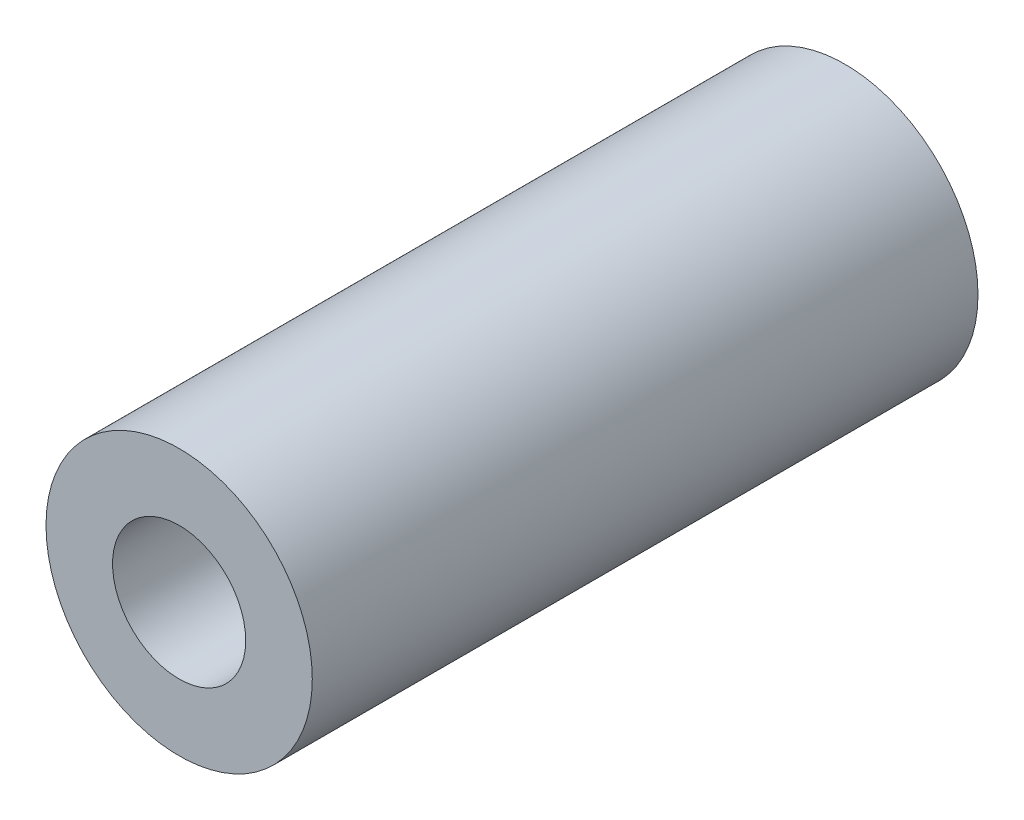
ISO-10303-21;
HEADER;
FILE_DESCRIPTION(('STEP AP214'),'2;1');
FILE_NAME('part.step','',(''),(''),'','','');
FILE_SCHEMA(('AUTOMOTIVE_DESIGN { 1 0 10303 214 1 1 1 1 }'));
ENDSEC;
DATA;
#1=APPLICATION_CONTEXT('core data for automotive mechanical design processes');
#2=APPLICATION_PROTOCOL_DEFINITION('international standard','automotive_design',2000,#1);
#3=PRODUCT_CONTEXT('',#1,'mechanical');
#4=PRODUCT('Part','Part','',(#3));
#5=PRODUCT_RELATED_PRODUCT_CATEGORY('part','',(#4));
#6=PRODUCT_DEFINITION_FORMATION('','',#4);
#7=PRODUCT_DEFINITION_CONTEXT('part definition',#1,'design');
#8=PRODUCT_DEFINITION('design','',#6,#7);
#9=PRODUCT_DEFINITION_SHAPE('','',#8);
#10=(LENGTH_UNIT() NAMED_UNIT(*) SI_UNIT(.MILLI.,.METRE.));
#11=(NAMED_UNIT(*) PLANE_ANGLE_UNIT() SI_UNIT($,.RADIAN.));
#12=(NAMED_UNIT(*) SI_UNIT($,.STERADIAN.) SOLID_ANGLE_UNIT());
#13=UNCERTAINTY_MEASURE_WITH_UNIT(LENGTH_MEASURE(1.E-05),#10,'distance_accuracy_value','');
#14=(GEOMETRIC_REPRESENTATION_CONTEXT(3) GLOBAL_UNCERTAINTY_ASSIGNED_CONTEXT((#13)) GLOBAL_UNIT_ASSIGNED_CONTEXT((#10,
#11,#12)) REPRESENTATION_CONTEXT('',''));
#15=CARTESIAN_POINT('',(0.,0.,0.));
#16=DIRECTION('',(0.,0.,1.));
#17=DIRECTION('',(1.,0.,0.));
#18=AXIS2_PLACEMENT_3D('',#15,#16,#17);
#19=CARTESIAN_POINT('',(0.,0.,10.));
#20=DIRECTION('',(0.,0.,1.));
#21=DIRECTION('',(1.,0.,0.));
#22=AXIS2_PLACEMENT_3D('',#19,#20,#21);
#23=PLANE('',#22);
#24=CARTESIAN_POINT('',(0.,0.,10.));
#25=DIRECTION('',(0.,0.,1.));
#26=DIRECTION('',(1.,0.,0.));
#27=AXIS2_PLACEMENT_3D('',#24,#25,#26);
#28=CIRCLE('',#27,2.);
#29=CARTESIAN_POINT('',(2.,0.,10.));
#30=VERTEX_POINT('',#29);
#31=EDGE_CURVE('E66',#30,#30,#28,.T.);
#32=ORIENTED_EDGE('',*,*,#31,.T.);
#33=EDGE_LOOP('',(#32));
#34=FACE_BOUND('',#33,.T.);
#35=CARTESIAN_POINT('',(0.,0.,10.));
#36=DIRECTION('',(0.,0.,1.));
#37=DIRECTION('',(1.,0.,0.));
#38=AXIS2_PLACEMENT_3D('',#35,#36,#37);
#39=CIRCLE('',#38,1.);
#40=CARTESIAN_POINT('',(1.,0.,10.));
#41=VERTEX_POINT('',#40);
#42=EDGE_CURVE('E100',#41,#41,#39,.T.);
#43=ORIENTED_EDGE('',*,*,#42,.F.);
#44=EDGE_LOOP('',(#43));
#45=FACE_BOUND('',#44,.T.);
#46=ADVANCED_FACE('F33',(#34,#45),#23,.T.);
#47=CARTESIAN_POINT('',(0.,0.,0.));
#48=DIRECTION('',(0.,0.,1.));
#49=DIRECTION('',(1.,0.,0.));
#50=AXIS2_PLACEMENT_3D('',#47,#48,#49);
#51=PLANE('',#50);
#52=CARTESIAN_POINT('',(0.,0.,0.));
#53=DIRECTION('',(0.,0.,1.));
#54=DIRECTION('',(1.,0.,0.));
#55=AXIS2_PLACEMENT_3D('',#52,#53,#54);
#56=CIRCLE('',#55,2.);
#57=CARTESIAN_POINT('',(2.,0.,0.));
#58=VERTEX_POINT('',#57);
#59=EDGE_CURVE('E103',#58,#58,#56,.T.);
#60=ORIENTED_EDGE('',*,*,#59,.F.);
#61=EDGE_LOOP('',(#60));
#62=FACE_BOUND('',#61,.T.);
#63=CARTESIAN_POINT('',(0.,0.,0.));
#64=DIRECTION('',(0.,0.,1.));
#65=DIRECTION('',(1.,0.,0.));
#66=AXIS2_PLACEMENT_3D('',#63,#64,#65);
#67=CIRCLE('',#66,1.);
#68=CARTESIAN_POINT('',(1.,0.,0.));
#69=VERTEX_POINT('',#68);
#70=EDGE_CURVE('E99',#69,#69,#67,.T.);
#71=ORIENTED_EDGE('',*,*,#70,.T.);
#72=EDGE_LOOP('',(#71));
#73=FACE_BOUND('',#72,.T.);
#74=ADVANCED_FACE('F111',(#62,#73),#51,.F.);
#75=CARTESIAN_POINT('',(0.,0.,10.));
#76=DIRECTION('',(0.,0.,-1.));
#77=DIRECTION('',(-1.,0.,0.));
#78=AXIS2_PLACEMENT_3D('',#75,#76,#77);
#79=CYLINDRICAL_SURFACE('',#78,2.);
#80=CARTESIAN_POINT('',(-2.,0.,2.71095));
#81=CARTESIAN_POINT('',(-1.99999648723784,0.065167737982772,2.71095375462478));
#82=CARTESIAN_POINT('',(-1.99678434338157,0.130370483013649,2.71592202732706));
#83=CARTESIAN_POINT('',(-1.98424617946316,0.258725908152528,2.73550903529616));
#84=CARTESIAN_POINT('',(-1.97491408735255,0.321876486776672,2.75013735510309));
#85=CARTESIAN_POINT('',(-1.95106736485164,0.444067176393795,2.7881701410669));
#86=CARTESIAN_POINT('',(-1.93657728578644,0.503125203079368,2.81153305776181));
#87=CARTESIAN_POINT('',(-1.90360002555391,0.616266693541774,2.86606271548572));
#88=CARTESIAN_POINT('',(-1.88511256993597,0.670349815389571,2.89722999236722));
#89=CARTESIAN_POINT('',(-1.84384321961621,0.7770302428952,2.96929472969139));
#90=CARTESIAN_POINT('',(-1.82083314015086,0.829139166545481,3.01078178119877));
#91=CARTESIAN_POINT('',(-1.77347282262379,0.926128524160324,3.10092932136109));
#92=CARTESIAN_POINT('',(-1.7491207665335,0.970998811774901,3.14959969908872));
#93=CARTESIAN_POINT('',(-1.69754639774823,1.05891046502727,3.26100975927525));
#94=CARTESIAN_POINT('',(-1.67042318275437,1.10073164102683,3.32476613147918));
#95=CARTESIAN_POINT('',(-1.62051370578226,1.17297334798858,3.45997039658612));
#96=CARTESIAN_POINT('',(-1.59772001613453,1.20341349259878,3.53140478130664));
#97=CARTESIAN_POINT('',(-1.56559101453485,1.24475492944445,3.66018362725927));
#98=CARTESIAN_POINT('',(-1.55428020251651,1.25872209890613,3.71604690600869));
#99=CARTESIAN_POINT('',(-1.53756497024471,1.27909062285749,3.82996385295507));
#100=CARTESIAN_POINT('',(-1.53215137771923,1.28550372786894,3.88801397390373));
#101=CARTESIAN_POINT('',(-1.52805632142403,1.29037065838595,4.00488428094427));
#102=CARTESIAN_POINT('',(-1.5293967034274,1.28879865587834,4.06370635131187));
#103=CARTESIAN_POINT('',(-1.53863844516895,1.27774772392529,4.18009541008909));
#104=CARTESIAN_POINT('',(-1.54654525451818,1.26826222688057,4.2376613152428));
#105=CARTESIAN_POINT('',(-1.5673966341176,1.24238840648332,4.3482021898132));
#106=CARTESIAN_POINT('',(-1.58017171147047,1.22623094136132,4.40126515236337));
#107=CARTESIAN_POINT('',(-1.60932961977698,1.18770386808887,4.50400737485829));
#108=CARTESIAN_POINT('',(-1.62571364341523,1.1653322056309,4.5536855090619));
#109=CARTESIAN_POINT('',(-1.66410130352081,1.11000344543621,4.65856814016826));
#110=CARTESIAN_POINT('',(-1.68657759839896,1.07583247786185,4.71295833616382));
#111=CARTESIAN_POINT('',(-1.73258422953482,1.00006068281097,4.81585401554424));
#112=CARTESIAN_POINT('',(-1.75611580069316,0.958450970951189,4.86435234441452));
#113=CARTESIAN_POINT('',(-1.80674821164721,0.859814571293041,4.96339311941244));
#114=CARTESIAN_POINT('',(-1.83368994974637,0.801360081160853,5.01261056981689));
#115=CARTESIAN_POINT('',(-1.88366724266534,0.675547340102675,5.10052551515804));
#116=CARTESIAN_POINT('',(-1.90670689178619,0.608198555361343,5.13923406270113));
#117=CARTESIAN_POINT('',(-1.94240847922352,0.480159094072421,5.19792594018133));
#118=CARTESIAN_POINT('',(-1.95622218721637,0.42079412843155,5.2200999553022));
#119=CARTESIAN_POINT('',(-1.97856693497824,0.298535128665473,5.2556151015817));
#120=CARTESIAN_POINT('',(-1.98710226353511,0.235644005054258,5.26896340441798));
#121=CARTESIAN_POINT('',(-1.99812522144204,0.107811854794137,5.28615649911869));
#122=CARTESIAN_POINT('',(-2.00059163816014,0.0428644394233644,5.28996795768829));
#123=CARTESIAN_POINT('',(-1.99916710753198,-0.0867959339275948,5.28775771308105));
#124=CARTESIAN_POINT('',(-1.99527590902767,-0.151508882543937,5.28173562142912));
#125=CARTESIAN_POINT('',(-1.98191225562139,-0.275089617102515,5.26082720710148));
#126=CARTESIAN_POINT('',(-1.97276411752539,-0.33408189373329,5.24645547490619));
#127=CARTESIAN_POINT('',(-1.94990311537933,-0.448658025481737,5.20994795895465));
#128=CARTESIAN_POINT('',(-1.93618948671255,-0.50424130782194,5.18781087464368));
#129=CARTESIAN_POINT('',(-1.90407345315059,-0.614864054823506,5.13473543016663));
#130=CARTESIAN_POINT('',(-1.88540407100072,-0.669574716082009,5.10327715036559));
#131=CARTESIAN_POINT('',(-1.84533685365772,-0.77319074000912,5.03331533695288));
#132=CARTESIAN_POINT('',(-1.82393697751677,-0.822091706789152,4.99480652385495));
#133=CARTESIAN_POINT('',(-1.77648218011437,-0.920619409913459,4.90510107456109));
#134=CARTESIAN_POINT('',(-1.75021773177379,-0.969199436015183,4.85286386143595));
#135=CARTESIAN_POINT('',(-1.69845377056349,-1.05729134413475,4.74085340653544));
#136=CARTESIAN_POINT('',(-1.67295446698287,-1.09680076438609,4.68107812572863));
#137=CARTESIAN_POINT('',(-1.62865940669592,-1.16137862409304,4.56283215103183));
#138=CARTESIAN_POINT('',(-1.60942321502515,-1.18765286670557,4.50518919337232));
#139=CARTESIAN_POINT('',(-1.57594152679878,-1.23173785204809,4.38539948045304));
#140=CARTESIAN_POINT('',(-1.56168925610576,-1.24956009455793,4.32325897808888));
#141=CARTESIAN_POINT('',(-1.54026322111922,-1.27588859511656,4.19511225773113));
#142=CARTESIAN_POINT('',(-1.53316093803208,-1.28430086879804,4.12907385699148));
#143=CARTESIAN_POINT('',(-1.52773467722786,-1.29075602786149,3.99615236014558));
#144=CARTESIAN_POINT('',(-1.52940309413689,-1.2888078970874,3.929270046022));
#145=CARTESIAN_POINT('',(-1.5402288476632,-1.27582980034042,3.80742548225821));
#146=CARTESIAN_POINT('',(-1.54821283640159,-1.26622103028561,3.75219294648086));
#147=CARTESIAN_POINT('',(-1.56909773275725,-1.2402455693829,3.64429665457542));
#148=CARTESIAN_POINT('',(-1.58200358191949,-1.22387208538477,3.59163554028939));
#149=CARTESIAN_POINT('',(-1.61637720431071,-1.17829921878191,3.47213438769121));
#150=CARTESIAN_POINT('',(-1.63926305271541,-1.14662529898609,3.40664851463977));
#151=CARTESIAN_POINT('',(-1.68809417828115,-1.07344088716677,3.28266243780609));
#152=CARTESIAN_POINT('',(-1.71404411073424,-1.03191532830074,3.22417314256659));
#153=CARTESIAN_POINT('',(-1.76653870930484,-0.939262938599474,3.11418410334728));
#154=CARTESIAN_POINT('',(-1.79308672081683,-0.888018244778735,3.06278517241429));
#155=CARTESIAN_POINT('',(-1.84390923237518,-0.776992404688265,2.96888071850678));
#156=CARTESIAN_POINT('',(-1.86818583484652,-0.7172192844154,2.92636692552299));
#157=CARTESIAN_POINT('',(-1.90942948072095,-0.597958031199053,2.85620388062454));
#158=CARTESIAN_POINT('',(-1.92692993445005,-0.539357056655816,2.82736410298082));
#159=CARTESIAN_POINT('',(-1.95696565924725,-0.417384850095961,2.77863410475673));
#160=CARTESIAN_POINT('',(-1.96950861499835,-0.354021183721151,2.7587300262719));
#161=CARTESIAN_POINT('',(-1.98587132747664,-0.242040987471451,2.73295534843833));
#162=CARTESIAN_POINT('',(-1.99114192622221,-0.19416665478812,2.72472990297464));
#163=CARTESIAN_POINT('',(-1.99820767856898,-0.0975347863658123,2.71372566461052));
#164=CARTESIAN_POINT('',(-2.00000262925651,-0.0487771992288067,2.71094718971248));
#165=CARTESIAN_POINT('',(-2.,0.,2.71095));
#166=B_SPLINE_CURVE_WITH_KNOTS('',3,(#80,#81,#82,#83,#84,#85,#86,#87,#88,#89,#90,#91,#92,#93,
#94,#95,#96,#97,#98,#99,#100,#101,#102,#103,#104,#105,#106,#107,#108,#109,#110,#111,#112,#113,
#114,#115,#116,#117,#118,#119,#120,#121,#122,#123,#124,#125,#126,#127,#128,#129,#130,#131,#132,
#133,#134,#135,#136,#137,#138,#139,#140,#141,#142,#143,#144,#145,#146,#147,#148,#149,#150,#151,
#152,#153,#154,#155,#156,#157,#158,#159,#160,#161,#162,#163,#164,#165),.UNSPECIFIED.,.T.,.F.,(4,
2,2,2,2,2,2,2,2,2,2,2,2,2,2,2,2,2,2,2,2,2,2,2,2,2,2,2,2,2,2,2,2,2,2,2,2,2,2,2,2,2,4),(0.,
0.195305861162067,0.390805793328858,0.585387348804057,0.779982268042075,0.990588202470825,
1.20148682401208,1.44313017075294,1.68435513748168,1.85968892659836,2.03474961826694,
2.21037690760953,2.386150099426,2.55629258938099,2.72649139261546,2.92991495318333,
3.13358311364378,3.37548001267702,3.61712150533475,3.81087364002203,4.00446813970754,
4.19873835395291,4.39301624304257,4.57642865980548,4.75987180947785,4.95655512318553,
5.15338632152993,5.38051226636978,5.60769978061387,5.80555907265595,6.00314837972316,
6.2026940122721,6.40206664053632,6.57122227974058,6.74054820012856,6.9681223101184,
7.19604673560261,7.42693589767064,7.65760918868497,7.85962469747671,8.06132581954763,
8.20750116757212,8.35368504928019),.UNSPECIFIED.);
#167=CARTESIAN_POINT('',(-2.,0.,2.71095));
#168=VERTEX_POINT('',#167);
#169=EDGE_CURVE('E71',#168,#168,#166,.T.);
#170=ORIENTED_EDGE('',*,*,#169,.T.);
#171=EDGE_LOOP('',(#170));
#172=FACE_BOUND('',#171,.T.);
#173=ORIENTED_EDGE('',*,*,#31,.F.);
#174=EDGE_LOOP('',(#173));
#175=FACE_BOUND('',#174,.T.);
#176=ORIENTED_EDGE('',*,*,#59,.T.);
#177=EDGE_LOOP('',(#176));
#178=FACE_BOUND('',#177,.T.);
#179=ADVANCED_FACE('F35',(#172,#175,#178),#79,.T.);
#180=CARTESIAN_POINT('',(0.,0.,10.));
#181=DIRECTION('',(0.,0.,-1.));
#182=DIRECTION('',(-1.,0.,0.));
#183=AXIS2_PLACEMENT_3D('',#180,#181,#182);
#184=CYLINDRICAL_SURFACE('',#183,1.);
#185=DIRECTION('',(0.,0.,-1.));
#186=VECTOR('',#185,1.);
#187=CARTESIAN_POINT('',(0.,-1.,10.));
#188=LINE('',#187,#186);
#189=CARTESIAN_POINT('',(0.,-1.,4.81341865143357));
#190=VERTEX_POINT('',#189);
#191=CARTESIAN_POINT('',(0.,-1.,3.18658134856643));
#192=VERTEX_POINT('',#191);
#193=EDGE_CURVE('E11',#190,#192,#188,.T.);
#194=ORIENTED_EDGE('',*,*,#193,.F.);
#195=CARTESIAN_POINT('',(0.,1.,4.81341865143357));
#196=CARTESIAN_POINT('',(-0.0232443808185395,1.00000610709743,4.81340079935476));
#197=CARTESIAN_POINT('',(-0.0464665124751093,0.999189258342341,4.81441588174427));
#198=CARTESIAN_POINT('',(-0.0925798904276493,0.995971415737063,4.81835277126767));
#199=CARTESIAN_POINT('',(-0.11547183195243,0.993574485280848,4.82126968736888));
#200=CARTESIAN_POINT('',(-0.182701157263204,0.984197287286486,4.83252639266902));
#201=CARTESIAN_POINT('',(-0.226325285309829,0.975026388307743,4.8433820829777));
#202=CARTESIAN_POINT('',(-0.320156318820157,0.948892138951674,4.87276169646609));
#203=CARTESIAN_POINT('',(-0.36960261727361,0.930630556938943,4.89246836840258));
#204=CARTESIAN_POINT('',(-0.464035948441712,0.887348229355457,4.93552310180853));
#205=CARTESIAN_POINT('',(-0.508992480545537,0.862285055171761,4.95889361837479));
#206=CARTESIAN_POINT('',(-0.595239735993476,0.80524988123926,5.00730266078784));
#207=CARTESIAN_POINT('',(-0.636411145391811,0.773121236080975,5.03236824390703));
#208=CARTESIAN_POINT('',(-0.713480031196518,0.702613777915499,5.08158676517698));
#209=CARTESIAN_POINT('',(-0.749387518664827,0.664247129626824,5.1057413690895));
#210=CARTESIAN_POINT('',(-0.813902083079928,0.583202734202848,5.15046621715632));
#211=CARTESIAN_POINT('',(-0.842760419365648,0.540788134141567,5.17114725403587));
#212=CARTESIAN_POINT('',(-0.894167219478906,0.450716978287247,5.2086672834325));
#213=CARTESIAN_POINT('',(-0.916720193277552,0.403064203312858,5.22550902044563));
#214=CARTESIAN_POINT('',(-0.951480521839599,0.311002986981519,5.2517414014384));
#215=CARTESIAN_POINT('',(-0.964740731762395,0.267206857620222,5.26187642503082));
#216=CARTESIAN_POINT('',(-0.985206605201956,0.17743388346873,5.27759088676807));
#217=CARTESIAN_POINT('',(-0.992416405421317,0.131458551370855,5.28317343739297));
#218=CARTESIAN_POINT('',(-1.00035144556659,0.0384717484615333,5.28932016165592));
#219=CARTESIAN_POINT('',(-1.00105745940323,-0.0085423828293261,5.28986945626986));
#220=CARTESIAN_POINT('',(-0.995886040165802,-0.101986616634094,5.28586013950271));
#221=CARTESIAN_POINT('',(-0.99000769068671,-0.14841663694244,5.28130081710945));
#222=CARTESIAN_POINT('',(-0.972449001026691,-0.237287512231681,5.26778446349095));
#223=CARTESIAN_POINT('',(-0.961037347900523,-0.279813966352587,5.25903129154546));
#224=CARTESIAN_POINT('',(-0.933123355474413,-0.362179204051375,5.23785564627742));
#225=CARTESIAN_POINT('',(-0.916619681831836,-0.402017279812254,5.2254322112141));
#226=CARTESIAN_POINT('',(-0.877205693068114,-0.482409306506727,5.19622160838156));
#227=CARTESIAN_POINT('',(-0.853807072861659,-0.522605498427125,5.17911467431192));
#228=CARTESIAN_POINT('',(-0.802349315198059,-0.598619733877318,5.14240499874515));
#229=CARTESIAN_POINT('',(-0.774287589991293,-0.634435327165684,5.12280087287118));
#230=CARTESIAN_POINT('',(-0.707970758484932,-0.708320988402041,5.07803250017624));
#231=CARTESIAN_POINT('',(-0.668802469468262,-0.745376105967183,5.05254676863856));
#232=CARTESIAN_POINT('',(-0.585040203766604,-0.812789022966003,5.00140577092324));
#233=CARTESIAN_POINT('',(-0.540437267716191,-0.843135524611258,4.97575029257715));
#234=CARTESIAN_POINT('',(-0.453472606010368,-0.892438770640113,4.93066375923911));
#235=CARTESIAN_POINT('',(-0.411882206836426,-0.91243930702226,4.91089162876004));
#236=CARTESIAN_POINT('',(-0.325138412633138,-0.946808045783929,4.87510918697421));
#237=CARTESIAN_POINT('',(-0.280007020647195,-0.961208160856535,4.85907777590716));
#238=CARTESIAN_POINT('',(-0.1961191307253,-0.981317863565384,4.83597451740039));
#239=CARTESIAN_POINT('',(-0.157987027424466,-0.988211596270296,4.82773306935531));
#240=CARTESIAN_POINT('',(-0.099593694953126,-0.99522515661221,4.81926183682204));
#241=CARTESIAN_POINT('',(-0.0798017138783578,-0.997008988504122,4.81708544806664));
#242=CARTESIAN_POINT('',(-0.0400109625265448,-0.999399017901301,4.81415784318564));
#243=CARTESIAN_POINT('',(-0.0200119106191002,-1.00000331477001,4.81340892725519));
#244=CARTESIAN_POINT('',(0.,-1.,4.81341865143357));
#245=B_SPLINE_CURVE_WITH_KNOTS('',3,(#195,#196,#197,#198,#199,#200,#201,#202,#203,#204,#205,
#206,#207,#208,#209,#210,#211,#212,#213,#214,#215,#216,#217,#218,#219,#220,#221,#222,#223,#224,
#225,#226,#227,#228,#229,#230,#231,#232,#233,#234,#235,#236,#237,#238,#239,#240,#241,#242,#243,
#244),.UNSPECIFIED.,.F.,.F.,(4,2,2,2,2,2,2,2,2,2,2,2,2,2,2,2,2,2,2,2,2,2,2,2,4),(0.,
0.0696581862862629,0.139137932307239,0.275941275432142,0.443871169479806,0.612873703659868,
0.786089031244092,0.958970536454251,1.12426368616393,1.28943830411746,1.42944065405226,
1.56934720534689,1.70966720745338,1.85000674158258,1.98412651176673,2.11828145736704,
2.26641191227847,2.41462484711577,2.59288497502333,2.77144305669664,2.92160932528904,
3.07090691028487,3.18917700640645,3.24907036294293,3.30906014886284),.UNSPECIFIED.);
#246=CARTESIAN_POINT('',(0.,1.,4.81341865143357));
#247=VERTEX_POINT('',#246);
#248=EDGE_CURVE('E65',#247,#190,#245,.T.);
#249=ORIENTED_EDGE('',*,*,#248,.F.);
#250=DIRECTION('',(0.,0.,-1.));
#251=VECTOR('',#250,1.);
#252=CARTESIAN_POINT('',(0.,1.,10.));
#253=LINE('',#252,#251);
#254=CARTESIAN_POINT('',(0.,1.,3.18658134856643));
#255=VERTEX_POINT('',#254);
#256=EDGE_CURVE('E60',#255,#247,#253,.F.);
#257=ORIENTED_EDGE('',*,*,#256,.F.);
#258=CARTESIAN_POINT('',(0.,-1.,3.18658134856643));
#259=CARTESIAN_POINT('',(-0.0232443808185396,-1.00000610709743,3.18659920064524));
#260=CARTESIAN_POINT('',(-0.0464665124751094,-0.999189258342341,3.18558411825573));
#261=CARTESIAN_POINT('',(-0.0925798904276494,-0.995971415737063,3.18164722873233));
#262=CARTESIAN_POINT('',(-0.115471831952431,-0.993574485280848,3.17873031263112));
#263=CARTESIAN_POINT('',(-0.182701157263204,-0.984197287286486,3.16747360733098));
#264=CARTESIAN_POINT('',(-0.226325285309829,-0.975026388307743,3.1566179170223));
#265=CARTESIAN_POINT('',(-0.320156318820157,-0.948892138951674,3.12723830353391));
#266=CARTESIAN_POINT('',(-0.36960261727361,-0.930630556938943,3.10753163159742));
#267=CARTESIAN_POINT('',(-0.464035948441711,-0.887348229355457,3.06447689819147));
#268=CARTESIAN_POINT('',(-0.508992480545536,-0.862285055171761,3.04110638162521));
#269=CARTESIAN_POINT('',(-0.595239735993476,-0.80524988123926,2.99269733921216));
#270=CARTESIAN_POINT('',(-0.636411145391811,-0.773121236080976,2.96763175609297));
#271=CARTESIAN_POINT('',(-0.713480031196518,-0.702613777915499,2.91841323482302));
#272=CARTESIAN_POINT('',(-0.749387518664828,-0.664247129626824,2.8942586309105));
#273=CARTESIAN_POINT('',(-0.813902083079928,-0.583202734202847,2.84953378284368));
#274=CARTESIAN_POINT('',(-0.842760419365648,-0.540788134141567,2.82885274596413));
#275=CARTESIAN_POINT('',(-0.894167219478906,-0.450716978287247,2.7913327165675));
#276=CARTESIAN_POINT('',(-0.916720193277552,-0.403064203312859,2.77449097955437));
#277=CARTESIAN_POINT('',(-0.951480521839599,-0.311002986981519,2.7482585985616));
#278=CARTESIAN_POINT('',(-0.964740731762395,-0.267206857620222,2.73812357496918));
#279=CARTESIAN_POINT('',(-0.985206605201956,-0.17743388346873,2.72240911323193));
#280=CARTESIAN_POINT('',(-0.992416405421317,-0.131458551370855,2.71682656260703));
#281=CARTESIAN_POINT('',(-1.00035144556659,-0.0384717484615335,2.71067983834408));
#282=CARTESIAN_POINT('',(-1.00105745940323,0.00854238282932598,2.71013054373014));
#283=CARTESIAN_POINT('',(-0.995886040165802,0.101986616634094,2.71413986049729));
#284=CARTESIAN_POINT('',(-0.99000769068671,0.14841663694244,2.71869918289055));
#285=CARTESIAN_POINT('',(-0.972449001026691,0.237287512231681,2.73221553650905));
#286=CARTESIAN_POINT('',(-0.961037347900523,0.279813966352587,2.74096870845454));
#287=CARTESIAN_POINT('',(-0.933123355474413,0.362179204051375,2.76214435372258));
#288=CARTESIAN_POINT('',(-0.916619681831836,0.402017279812254,2.7745677887859));
#289=CARTESIAN_POINT('',(-0.877205693068114,0.482409306506726,2.80377839161845));
#290=CARTESIAN_POINT('',(-0.85380707286166,0.522605498427124,2.82088532568808));
#291=CARTESIAN_POINT('',(-0.802349315198059,0.598619733877317,2.85759500125485));
#292=CARTESIAN_POINT('',(-0.774287589991294,0.634435327165684,2.87719912712882));
#293=CARTESIAN_POINT('',(-0.707970758484933,0.708320988402041,2.92196749982376));
#294=CARTESIAN_POINT('',(-0.668802469468262,0.745376105967182,2.94745323136144));
#295=CARTESIAN_POINT('',(-0.585040203766604,0.812789022966003,2.99859422907676));
#296=CARTESIAN_POINT('',(-0.540437267716191,0.843135524611258,3.02424970742285));
#297=CARTESIAN_POINT('',(-0.453472606010368,0.892438770640113,3.06933624076089));
#298=CARTESIAN_POINT('',(-0.411882206836426,0.91243930702226,3.08910837123996));
#299=CARTESIAN_POINT('',(-0.325138412633138,0.946808045783928,3.12489081302579));
#300=CARTESIAN_POINT('',(-0.280007020647195,0.961208160856535,3.14092222409284));
#301=CARTESIAN_POINT('',(-0.1961191307253,0.981317863565384,3.16402548259961));
#302=CARTESIAN_POINT('',(-0.157987027424466,0.988211596270296,3.17226693064469));
#303=CARTESIAN_POINT('',(-0.0995936949531261,0.99522515661221,3.18073816317796));
#304=CARTESIAN_POINT('',(-0.0798017138783579,0.997008988504122,3.18291455193335));
#305=CARTESIAN_POINT('',(-0.0400109625265449,0.999399017901301,3.18584215681436));
#306=CARTESIAN_POINT('',(-0.0200119106191004,1.00000331477001,3.18659107274481));
#307=CARTESIAN_POINT('',(0.,1.,3.18658134856643));
#308=B_SPLINE_CURVE_WITH_KNOTS('',3,(#258,#259,#260,#261,#262,#263,#264,#265,#266,#267,#268,
#269,#270,#271,#272,#273,#274,#275,#276,#277,#278,#279,#280,#281,#282,#283,#284,#285,#286,#287,
#288,#289,#290,#291,#292,#293,#294,#295,#296,#297,#298,#299,#300,#301,#302,#303,#304,#305,#306,
#307),.UNSPECIFIED.,.F.,.F.,(4,2,2,2,2,2,2,2,2,2,2,2,2,2,2,2,2,2,2,2,2,2,2,2,4),(0.,
0.0696581862862629,0.139137932307239,0.275941275432142,0.443871169479806,0.612873703659868,
0.786089031244092,0.958970536454252,1.12426368616393,1.28943830411746,1.42944065405226,
1.56934720534688,1.70966720745338,1.85000674158258,1.98412651176673,2.11828145736704,
2.26641191227847,2.41462484711577,2.59288497502333,2.77144305669664,2.92160932528904,
3.07090691028487,3.18917700640645,3.24907036294293,3.30906014886284),.UNSPECIFIED.);
#309=EDGE_CURVE('E42',#192,#255,#308,.T.);
#310=ORIENTED_EDGE('',*,*,#309,.F.);
#311=EDGE_LOOP('',(#194,#249,#257,#310));
#312=FACE_BOUND('',#311,.T.);
#313=ORIENTED_EDGE('',*,*,#42,.T.);
#314=EDGE_LOOP('',(#313));
#315=FACE_BOUND('',#314,.T.);
#316=ORIENTED_EDGE('',*,*,#70,.F.);
#317=EDGE_LOOP('',(#316));
#318=FACE_BOUND('',#317,.T.);
#319=ADVANCED_FACE('F74',(#312,#315,#318),#184,.F.);
#320=CARTESIAN_POINT('',(-2.,0.,4.));
#321=DIRECTION('',(1.,0.,0.));
#322=DIRECTION('',(0.,0.,-1.));
#323=AXIS2_PLACEMENT_3D('',#320,#321,#322);
#324=CYLINDRICAL_SURFACE('',#323,1.28905);
#325=ORIENTED_EDGE('',*,*,#309,.T.);
#326=CARTESIAN_POINT('',(0.,0.,4.));
#327=DIRECTION('',(1.,0.,0.));
#328=DIRECTION('',(0.,0.,-1.));
#329=AXIS2_PLACEMENT_3D('',#326,#327,#328);
#330=CIRCLE('',#329,1.28905);
#331=EDGE_CURVE('E48',#255,#247,#330,.T.);
#332=ORIENTED_EDGE('',*,*,#331,.T.);
#333=ORIENTED_EDGE('',*,*,#248,.T.);
#334=EDGE_CURVE('E72',#190,#192,#330,.T.);
#335=ORIENTED_EDGE('',*,*,#334,.T.);
#336=EDGE_LOOP('',(#325,#332,#333,#335));
#337=FACE_BOUND('',#336,.T.);
#338=ORIENTED_EDGE('',*,*,#169,.F.);
#339=EDGE_LOOP('',(#338));
#340=FACE_BOUND('',#339,.T.);
#341=ADVANCED_FACE('F69',(#337,#340),#324,.F.);
#342=CARTESIAN_POINT('',(0.,0.,4.));
#343=DIRECTION('',(1.,0.,0.));
#344=DIRECTION('',(0.,0.,-1.));
#345=AXIS2_PLACEMENT_3D('',#342,#343,#344);
#346=PLANE('',#345);
#347=ORIENTED_EDGE('',*,*,#193,.T.);
#348=ORIENTED_EDGE('',*,*,#334,.F.);
#349=EDGE_LOOP('',(#347,#348));
#350=FACE_BOUND('',#349,.T.);
#351=ADVANCED_FACE('F91',(#350),#346,.F.);
#352=ORIENTED_EDGE('',*,*,#256,.T.);
#353=ORIENTED_EDGE('',*,*,#331,.F.);
#354=EDGE_LOOP('',(#352,#353));
#355=FACE_BOUND('',#354,.T.);
#356=ADVANCED_FACE('F61',(#355),#346,.F.);
#357=CLOSED_SHELL('',(#46,#74,#179,#319,#341,#351,#356));
#358=MANIFOLD_SOLID_BREP('B2',#357);
#359=ADVANCED_BREP_SHAPE_REPRESENTATION('',(#18,#358),#14);
#360=SHAPE_DEFINITION_REPRESENTATION(#9,#359);
ENDSEC;
END-ISO-10303-21;
